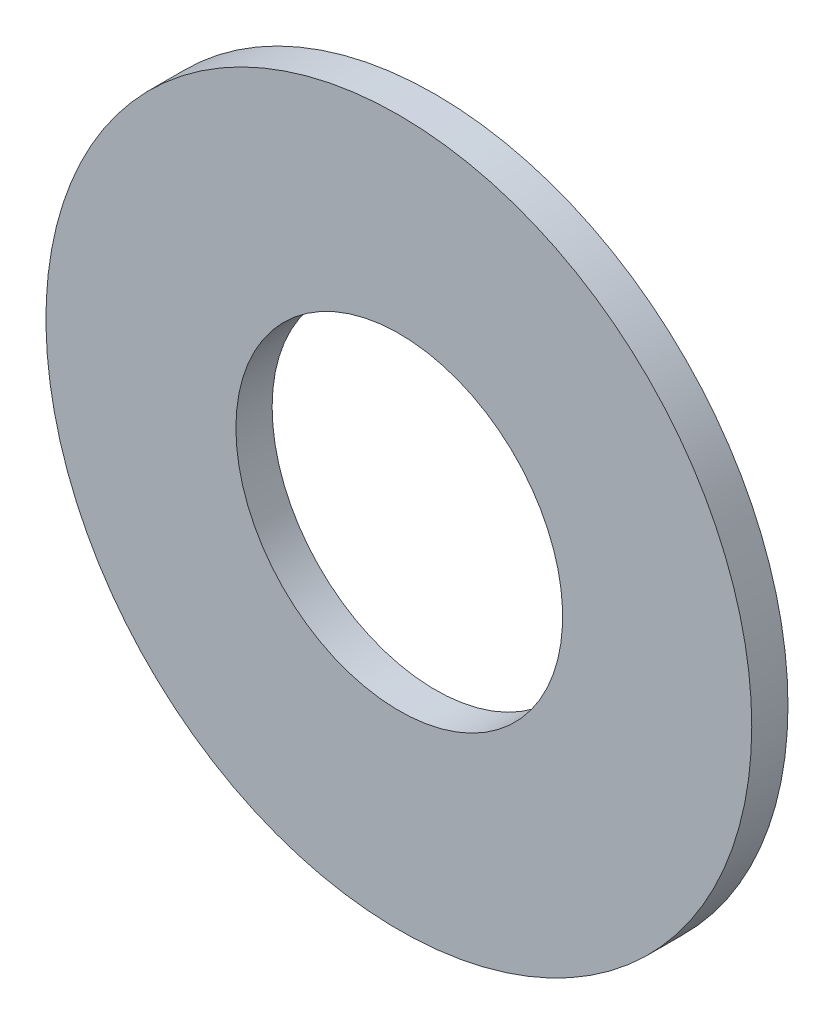
ISO-10303-21;
HEADER;
FILE_DESCRIPTION(('STEP AP214'),'2;1');
FILE_NAME('part.step','',(''),(''),'','','');
FILE_SCHEMA(('AUTOMOTIVE_DESIGN { 1 0 10303 214 1 1 1 1 }'));
ENDSEC;
DATA;
#1=APPLICATION_CONTEXT('core data for automotive mechanical design processes');
#2=APPLICATION_PROTOCOL_DEFINITION('international standard','automotive_design',2000,#1);
#3=PRODUCT_CONTEXT('',#1,'mechanical');
#4=PRODUCT('Part','Part','',(#3));
#5=PRODUCT_RELATED_PRODUCT_CATEGORY('part','',(#4));
#6=PRODUCT_DEFINITION_FORMATION('','',#4);
#7=PRODUCT_DEFINITION_CONTEXT('part definition',#1,'design');
#8=PRODUCT_DEFINITION('design','',#6,#7);
#9=PRODUCT_DEFINITION_SHAPE('','',#8);
#10=(LENGTH_UNIT() NAMED_UNIT(*) SI_UNIT(.MILLI.,.METRE.));
#11=(NAMED_UNIT(*) PLANE_ANGLE_UNIT() SI_UNIT($,.RADIAN.));
#12=(NAMED_UNIT(*) SI_UNIT($,.STERADIAN.) SOLID_ANGLE_UNIT());
#13=UNCERTAINTY_MEASURE_WITH_UNIT(LENGTH_MEASURE(1.E-05),#10,'distance_accuracy_value','');
#14=(GEOMETRIC_REPRESENTATION_CONTEXT(3) GLOBAL_UNCERTAINTY_ASSIGNED_CONTEXT((#13)) GLOBAL_UNIT_ASSIGNED_CONTEXT((#10,
#11,#12)) REPRESENTATION_CONTEXT('',''));
#15=CARTESIAN_POINT('',(0.,0.,0.));
#16=DIRECTION('',(0.,0.,1.));
#17=DIRECTION('',(1.,0.,0.));
#18=AXIS2_PLACEMENT_3D('',#15,#16,#17);
#19=CARTESIAN_POINT('',(-0.204617614983458,0.258105770656361,-0.37));
#20=DIRECTION('',(0.,0.,-1.));
#21=DIRECTION('',(-0.806519248190402,0.591207833421031,0.));
#22=AXIS2_PLACEMENT_3D('',#19,#20,#21);
#23=CYLINDRICAL_SURFACE('',#22,0.013530294603023);
#24=CARTESIAN_POINT('',(-0.204617614983458,0.258105770656361,-0.373));
#25=DIRECTION('',(0.,0.,1.));
#26=DIRECTION('',(-0.806519248190402,0.591207833421031,0.));
#27=AXIS2_PLACEMENT_3D('',#24,#25,#26);
#28=CIRCLE('',#27,0.013530294603023);
#29=CARTESIAN_POINT('',(-0.218147882961353,0.258132612619026,-0.373));
#30=VERTEX_POINT('',#29);
#31=CARTESIAN_POINT('',(-0.193705171952433,0.250106554498559,-0.373));
#32=VERTEX_POINT('',#31);
#33=EDGE_CURVE('E11',#30,#32,#28,.T.);
#34=ORIENTED_EDGE('',*,*,#33,.F.);
#35=CARTESIAN_POINT('',(-0.204617614983458,0.258105770656361,-0.373));
#36=DIRECTION('',(0.,0.,1.));
#37=DIRECTION('',(-0.806519248190402,0.591207833421031,0.));
#38=AXIS2_PLACEMENT_3D('',#35,#36,#37);
#39=CIRCLE('',#38,0.013530294603023);
#40=EDGE_CURVE('E24',#32,#30,#39,.T.);
#41=ORIENTED_EDGE('',*,*,#40,.F.);
#42=DIRECTION('',(0.,0.,1.));
#43=VECTOR('',#42,1.);
#44=CARTESIAN_POINT('',(-0.193705171952433,0.250106554498559,-0.37));
#45=LINE('',#44,#43);
#46=CARTESIAN_POINT('',(-0.193705171952433,0.250106554498559,-0.37));
#47=VERTEX_POINT('',#46);
#48=EDGE_CURVE('E35',#32,#47,#45,.T.);
#49=ORIENTED_EDGE('',*,*,#48,.T.);
#50=CARTESIAN_POINT('',(-0.204617614983458,0.258105770656361,-0.37));
#51=DIRECTION('',(0.,0.,1.));
#52=DIRECTION('',(-0.806519248190402,0.591207833421031,0.));
#53=AXIS2_PLACEMENT_3D('',#50,#51,#52);
#54=CIRCLE('',#53,0.013530294603023);
#55=CARTESIAN_POINT('',(-0.218147882961353,0.258132612619026,-0.37));
#56=VERTEX_POINT('',#55);
#57=EDGE_CURVE('E76',#47,#56,#54,.T.);
#58=ORIENTED_EDGE('',*,*,#57,.T.);
#59=CARTESIAN_POINT('',(-0.204617614983458,0.258105770656361,-0.37));
#60=DIRECTION('',(0.,0.,1.));
#61=DIRECTION('',(-0.806519248190402,0.591207833421031,0.));
#62=AXIS2_PLACEMENT_3D('',#59,#60,#61);
#63=CIRCLE('',#62,0.013530294603023);
#64=EDGE_CURVE('E74',#56,#47,#63,.T.);
#65=ORIENTED_EDGE('',*,*,#64,.T.);
#66=ORIENTED_EDGE('',*,*,#48,.F.);
#67=EDGE_LOOP('',(#34,#41,#49,#58,#65,#66));
#68=FACE_BOUND('',#67,.T.);
#69=ADVANCED_FACE('F17',(#68),#23,.F.);
#70=CARTESIAN_POINT('',(-0.204652409972007,0.258071086612246,-0.37));
#71=DIRECTION('',(0.,0.,-1.));
#72=DIRECTION('',(-0.0019457927679564,-0.99999810694346,0.));
#73=AXIS2_PLACEMENT_3D('',#70,#71,#72);
#74=CYLINDRICAL_SURFACE('',#73,0.0292270554326151);
#75=CARTESIAN_POINT('',(-0.204652409972007,0.258071086612246,-0.373));
#76=DIRECTION('',(0.,0.,-1.));
#77=DIRECTION('',(-0.0019457927679564,-0.99999810694346,0.));
#78=AXIS2_PLACEMENT_3D('',#75,#76,#77);
#79=CIRCLE('',#78,0.0292270554326151);
#80=CARTESIAN_POINT('',(-0.17542541208077,0.258013090691995,-0.373));
#81=VERTEX_POINT('',#80);
#82=CARTESIAN_POINT('',(-0.204595540178918,0.287298086716393,-0.373));
#83=VERTEX_POINT('',#82);
#84=EDGE_CURVE('E72',#81,#83,#79,.T.);
#85=ORIENTED_EDGE('',*,*,#84,.F.);
#86=CARTESIAN_POINT('',(-0.204652409972007,0.258071086612246,-0.373));
#87=DIRECTION('',(0.,0.,-1.));
#88=DIRECTION('',(-0.0019457927679564,-0.99999810694346,0.));
#89=AXIS2_PLACEMENT_3D('',#86,#87,#88);
#90=CIRCLE('',#89,0.0292270554326151);
#91=EDGE_CURVE('E69',#83,#81,#90,.T.);
#92=ORIENTED_EDGE('',*,*,#91,.F.);
#93=DIRECTION('',(0.,0.,1.));
#94=VECTOR('',#93,1.);
#95=CARTESIAN_POINT('',(-0.204595540178918,0.287298086716393,-0.37));
#96=LINE('',#95,#94);
#97=CARTESIAN_POINT('',(-0.204595540178918,0.287298086716393,-0.37));
#98=VERTEX_POINT('',#97);
#99=EDGE_CURVE('E61',#83,#98,#96,.T.);
#100=ORIENTED_EDGE('',*,*,#99,.T.);
#101=CARTESIAN_POINT('',(-0.204652409972007,0.258071086612246,-0.37));
#102=DIRECTION('',(0.,0.,-1.));
#103=DIRECTION('',(-0.0019457927679564,-0.99999810694346,0.));
#104=AXIS2_PLACEMENT_3D('',#101,#102,#103);
#105=CIRCLE('',#104,0.0292270554326151);
#106=CARTESIAN_POINT('',(-0.17542541208077,0.258013090691995,-0.37));
#107=VERTEX_POINT('',#106);
#108=EDGE_CURVE('E55',#98,#107,#105,.T.);
#109=ORIENTED_EDGE('',*,*,#108,.T.);
#110=CARTESIAN_POINT('',(-0.204652409972007,0.258071086612246,-0.37));
#111=DIRECTION('',(0.,0.,-1.));
#112=DIRECTION('',(-0.0019457927679564,-0.99999810694346,0.));
#113=AXIS2_PLACEMENT_3D('',#110,#111,#112);
#114=CIRCLE('',#113,0.0292270554326151);
#115=EDGE_CURVE('E59',#107,#98,#114,.T.);
#116=ORIENTED_EDGE('',*,*,#115,.T.);
#117=ORIENTED_EDGE('',*,*,#99,.F.);
#118=EDGE_LOOP('',(#85,#92,#100,#109,#116,#117));
#119=FACE_BOUND('',#118,.T.);
#120=ADVANCED_FACE('F57',(#119),#74,.T.);
#121=CARTESIAN_POINT('',(-0.204651846348544,0.258070810405021,-0.373));
#122=DIRECTION('',(0.,0.,-1.));
#123=DIRECTION('',(-1.,0.,0.));
#124=AXIS2_PLACEMENT_3D('',#121,#122,#123);
#125=PLANE('',#124);
#126=ORIENTED_EDGE('',*,*,#84,.T.);
#127=ORIENTED_EDGE('',*,*,#91,.T.);
#128=EDGE_LOOP('',(#126,#127));
#129=FACE_BOUND('',#128,.T.);
#130=ORIENTED_EDGE('',*,*,#33,.T.);
#131=ORIENTED_EDGE('',*,*,#40,.T.);
#132=EDGE_LOOP('',(#130,#131));
#133=FACE_BOUND('',#132,.T.);
#134=ADVANCED_FACE('F81',(#129,#133),#125,.T.);
#135=CARTESIAN_POINT('',(-0.204651846348544,0.258070810405021,-0.37));
#136=DIRECTION('',(0.,0.,-1.));
#137=DIRECTION('',(-1.,0.,0.));
#138=AXIS2_PLACEMENT_3D('',#135,#136,#137);
#139=PLANE('',#138);
#140=ORIENTED_EDGE('',*,*,#115,.F.);
#141=ORIENTED_EDGE('',*,*,#108,.F.);
#142=EDGE_LOOP('',(#140,#141));
#143=FACE_BOUND('',#142,.T.);
#144=ORIENTED_EDGE('',*,*,#64,.F.);
#145=ORIENTED_EDGE('',*,*,#57,.F.);
#146=EDGE_LOOP('',(#144,#145));
#147=FACE_BOUND('',#146,.T.);
#148=ADVANCED_FACE('F64',(#143,#147),#139,.F.);
#149=CLOSED_SHELL('',(#69,#120,#134,#148));
#150=MANIFOLD_SOLID_BREP('B1',#149);
#151=ADVANCED_BREP_SHAPE_REPRESENTATION('',(#18,#150),#14);
#152=SHAPE_DEFINITION_REPRESENTATION(#9,#151);
ENDSEC;
END-ISO-10303-21;
